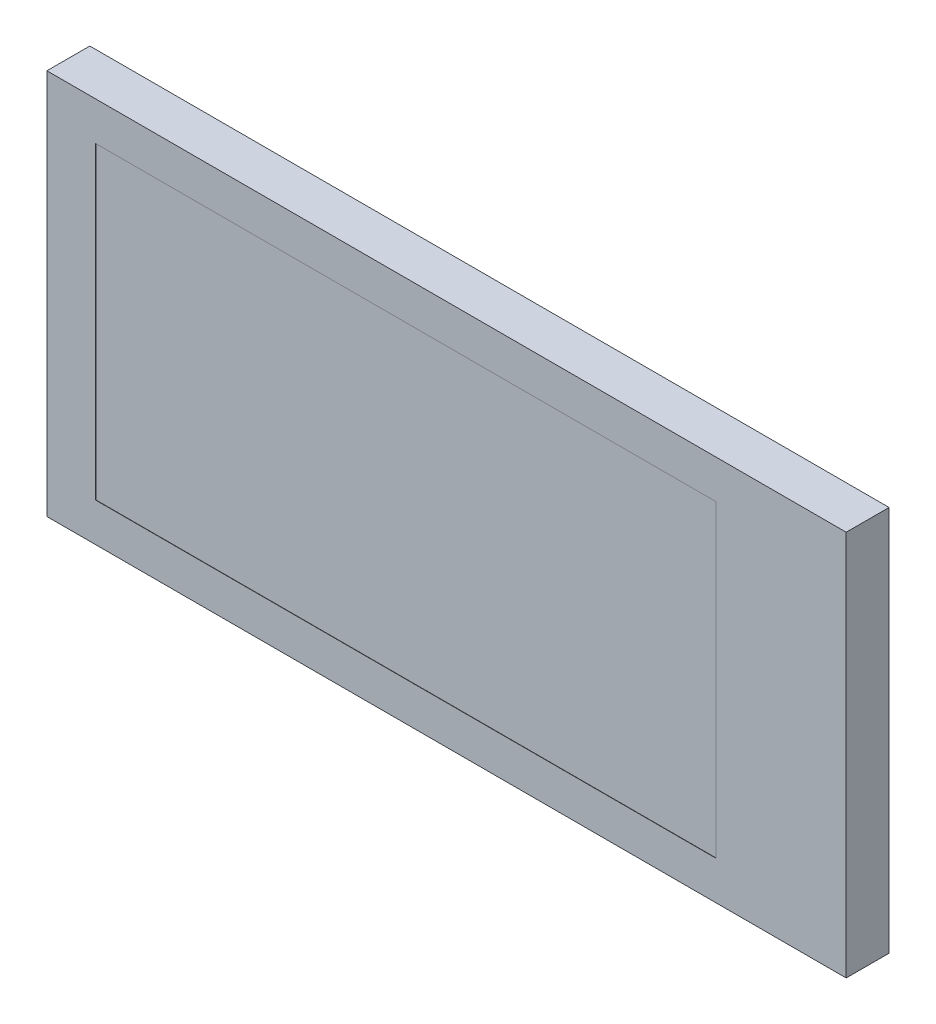
ISO-10303-21;
HEADER;
FILE_DESCRIPTION(('STEP AP214'),'2;1');
FILE_NAME('part.step','',(''),(''),'','','');
FILE_SCHEMA(('AUTOMOTIVE_DESIGN { 1 0 10303 214 1 1 1 1 }'));
ENDSEC;
DATA;
#1=APPLICATION_CONTEXT('core data for automotive mechanical design processes');
#2=APPLICATION_PROTOCOL_DEFINITION('international standard','automotive_design',2000,#1);
#3=PRODUCT_CONTEXT('',#1,'mechanical');
#4=PRODUCT('Part','Part','',(#3));
#5=PRODUCT_RELATED_PRODUCT_CATEGORY('part','',(#4));
#6=PRODUCT_DEFINITION_FORMATION('','',#4);
#7=PRODUCT_DEFINITION_CONTEXT('part definition',#1,'design');
#8=PRODUCT_DEFINITION('design','',#6,#7);
#9=PRODUCT_DEFINITION_SHAPE('','',#8);
#10=(LENGTH_UNIT() NAMED_UNIT(*) SI_UNIT(.MILLI.,.METRE.));
#11=(NAMED_UNIT(*) PLANE_ANGLE_UNIT() SI_UNIT($,.RADIAN.));
#12=(NAMED_UNIT(*) SI_UNIT($,.STERADIAN.) SOLID_ANGLE_UNIT());
#13=UNCERTAINTY_MEASURE_WITH_UNIT(LENGTH_MEASURE(1.E-05),#10,'distance_accuracy_value','');
#14=(GEOMETRIC_REPRESENTATION_CONTEXT(3) GLOBAL_UNCERTAINTY_ASSIGNED_CONTEXT((#13)) GLOBAL_UNIT_ASSIGNED_CONTEXT((#10,
#11,#12)) REPRESENTATION_CONTEXT('',''));
#15=CARTESIAN_POINT('',(0.,0.,0.));
#16=DIRECTION('',(0.,0.,1.));
#17=DIRECTION('',(1.,0.,0.));
#18=AXIS2_PLACEMENT_3D('',#15,#16,#17);
#19=CARTESIAN_POINT('',(0.,0.,1.5));
#20=DIRECTION('',(0.,0.,-1.));
#21=DIRECTION('',(-1.,0.,0.));
#22=AXIS2_PLACEMENT_3D('',#19,#20,#21);
#23=PLANE('',#22);
#24=DIRECTION('',(0.,-1.,0.));
#25=VECTOR('',#24,1.);
#26=CARTESIAN_POINT('',(0.,0.,1.5));
#27=LINE('',#26,#25);
#28=CARTESIAN_POINT('',(0.,13.5,1.5));
#29=VERTEX_POINT('',#28);
#30=CARTESIAN_POINT('',(0.,0.,1.5));
#31=VERTEX_POINT('',#30);
#32=EDGE_CURVE('E153',#29,#31,#27,.T.);
#33=ORIENTED_EDGE('',*,*,#32,.T.);
#34=DIRECTION('',(1.,0.,0.));
#35=VECTOR('',#34,1.);
#36=CARTESIAN_POINT('',(0.,0.,1.5));
#37=LINE('',#36,#35);
#38=CARTESIAN_POINT('',(27.95,0.,1.5));
#39=VERTEX_POINT('',#38);
#40=EDGE_CURVE('E157',#31,#39,#37,.T.);
#41=ORIENTED_EDGE('',*,*,#40,.T.);
#42=DIRECTION('',(0.,1.,0.));
#43=VECTOR('',#42,1.);
#44=CARTESIAN_POINT('',(27.95,0.,1.5));
#45=LINE('',#44,#43);
#46=CARTESIAN_POINT('',(27.95,13.5,1.5));
#47=VERTEX_POINT('',#46);
#48=EDGE_CURVE('E161',#39,#47,#45,.T.);
#49=ORIENTED_EDGE('',*,*,#48,.T.);
#50=DIRECTION('',(-1.,0.,0.));
#51=VECTOR('',#50,1.);
#52=CARTESIAN_POINT('',(0.,13.5,1.5));
#53=LINE('',#52,#51);
#54=EDGE_CURVE('E164',#47,#29,#53,.T.);
#55=ORIENTED_EDGE('',*,*,#54,.T.);
#56=EDGE_LOOP('',(#33,#41,#49,#55));
#57=FACE_BOUND('',#56,.T.);
#58=DIRECTION('',(0.,-1.,0.));
#59=VECTOR('',#58,1.);
#60=CARTESIAN_POINT('',(1.7,1.35,1.5));
#61=LINE('',#60,#59);
#62=CARTESIAN_POINT('',(1.7,12.15,1.5));
#63=VERTEX_POINT('',#62);
#64=CARTESIAN_POINT('',(1.7,1.35,1.5));
#65=VERTEX_POINT('',#64);
#66=EDGE_CURVE('E125',#63,#65,#61,.T.);
#67=ORIENTED_EDGE('',*,*,#66,.F.);
#68=DIRECTION('',(-1.,0.,0.));
#69=VECTOR('',#68,1.);
#70=CARTESIAN_POINT('',(1.7,12.15,1.5));
#71=LINE('',#70,#69);
#72=CARTESIAN_POINT('',(23.4,12.15,1.5));
#73=VERTEX_POINT('',#72);
#74=EDGE_CURVE('E113',#73,#63,#71,.T.);
#75=ORIENTED_EDGE('',*,*,#74,.F.);
#76=DIRECTION('',(0.,1.,0.));
#77=VECTOR('',#76,1.);
#78=CARTESIAN_POINT('',(23.4,1.35,1.5));
#79=LINE('',#78,#77);
#80=CARTESIAN_POINT('',(23.4,1.35,1.5));
#81=VERTEX_POINT('',#80);
#82=EDGE_CURVE('E139',#81,#73,#79,.T.);
#83=ORIENTED_EDGE('',*,*,#82,.F.);
#84=DIRECTION('',(1.,0.,0.));
#85=VECTOR('',#84,1.);
#86=CARTESIAN_POINT('',(1.7,1.35,1.5));
#87=LINE('',#86,#85);
#88=EDGE_CURVE('E136',#65,#81,#87,.T.);
#89=ORIENTED_EDGE('',*,*,#88,.F.);
#90=EDGE_LOOP('',(#67,#75,#83,#89));
#91=FACE_BOUND('',#90,.T.);
#92=ADVANCED_FACE('F39',(#57,#91),#23,.F.);
#93=CARTESIAN_POINT('',(0.,0.,0.));
#94=DIRECTION('',(0.,0.,-1.));
#95=DIRECTION('',(-1.,0.,0.));
#96=AXIS2_PLACEMENT_3D('',#93,#94,#95);
#97=PLANE('',#96);
#98=DIRECTION('',(0.,-1.,0.));
#99=VECTOR('',#98,1.);
#100=CARTESIAN_POINT('',(0.,0.,0.));
#101=LINE('',#100,#99);
#102=CARTESIAN_POINT('',(0.,13.5,0.));
#103=VERTEX_POINT('',#102);
#104=CARTESIAN_POINT('',(0.,0.,0.));
#105=VERTEX_POINT('',#104);
#106=EDGE_CURVE('E152',#103,#105,#101,.T.);
#107=ORIENTED_EDGE('',*,*,#106,.F.);
#108=DIRECTION('',(-1.,0.,0.));
#109=VECTOR('',#108,1.);
#110=CARTESIAN_POINT('',(0.,13.5,0.));
#111=LINE('',#110,#109);
#112=CARTESIAN_POINT('',(27.95,13.5,0.));
#113=VERTEX_POINT('',#112);
#114=EDGE_CURVE('E158',#113,#103,#111,.T.);
#115=ORIENTED_EDGE('',*,*,#114,.F.);
#116=DIRECTION('',(0.,1.,0.));
#117=VECTOR('',#116,1.);
#118=CARTESIAN_POINT('',(27.95,0.,0.));
#119=LINE('',#118,#117);
#120=CARTESIAN_POINT('',(27.95,0.,0.));
#121=VERTEX_POINT('',#120);
#122=EDGE_CURVE('E174',#121,#113,#119,.T.);
#123=ORIENTED_EDGE('',*,*,#122,.F.);
#124=DIRECTION('',(1.,0.,0.));
#125=VECTOR('',#124,1.);
#126=CARTESIAN_POINT('',(0.,0.,0.));
#127=LINE('',#126,#125);
#128=EDGE_CURVE('E171',#105,#121,#127,.T.);
#129=ORIENTED_EDGE('',*,*,#128,.F.);
#130=EDGE_LOOP('',(#107,#115,#123,#129));
#131=FACE_BOUND('',#130,.T.);
#132=ADVANCED_FACE('F197',(#131),#97,.T.);
#133=CARTESIAN_POINT('',(0.,0.,1.5));
#134=DIRECTION('',(1.,0.,0.));
#135=DIRECTION('',(0.,0.,-1.));
#136=AXIS2_PLACEMENT_3D('',#133,#134,#135);
#137=PLANE('',#136);
#138=ORIENTED_EDGE('',*,*,#106,.T.);
#139=DIRECTION('',(0.,0.,-1.));
#140=VECTOR('',#139,1.);
#141=CARTESIAN_POINT('',(0.,0.,1.5));
#142=LINE('',#141,#140);
#143=EDGE_CURVE('E11',#31,#105,#142,.T.);
#144=ORIENTED_EDGE('',*,*,#143,.F.);
#145=ORIENTED_EDGE('',*,*,#32,.F.);
#146=DIRECTION('',(0.,0.,-1.));
#147=VECTOR('',#146,1.);
#148=CARTESIAN_POINT('',(0.,13.5,1.5));
#149=LINE('',#148,#147);
#150=EDGE_CURVE('E167',#29,#103,#149,.T.);
#151=ORIENTED_EDGE('',*,*,#150,.T.);
#152=EDGE_LOOP('',(#138,#144,#145,#151));
#153=FACE_BOUND('',#152,.T.);
#154=ADVANCED_FACE('F41',(#153),#137,.F.);
#155=CARTESIAN_POINT('',(0.,0.,1.5));
#156=DIRECTION('',(0.,1.,0.));
#157=DIRECTION('',(0.,0.,1.));
#158=AXIS2_PLACEMENT_3D('',#155,#156,#157);
#159=PLANE('',#158);
#160=ORIENTED_EDGE('',*,*,#128,.T.);
#161=DIRECTION('',(0.,0.,-1.));
#162=VECTOR('',#161,1.);
#163=CARTESIAN_POINT('',(27.95,0.,1.5));
#164=LINE('',#163,#162);
#165=EDGE_CURVE('E48',#39,#121,#164,.T.);
#166=ORIENTED_EDGE('',*,*,#165,.F.);
#167=ORIENTED_EDGE('',*,*,#40,.F.);
#168=ORIENTED_EDGE('',*,*,#143,.T.);
#169=EDGE_LOOP('',(#160,#166,#167,#168));
#170=FACE_BOUND('',#169,.T.);
#171=ADVANCED_FACE('F207',(#170),#159,.F.);
#172=CARTESIAN_POINT('',(27.95,0.,1.5));
#173=DIRECTION('',(-1.,0.,0.));
#174=DIRECTION('',(0.,0.,1.));
#175=AXIS2_PLACEMENT_3D('',#172,#173,#174);
#176=PLANE('',#175);
#177=ORIENTED_EDGE('',*,*,#122,.T.);
#178=DIRECTION('',(0.,0.,-1.));
#179=VECTOR('',#178,1.);
#180=CARTESIAN_POINT('',(27.95,13.5,1.5));
#181=LINE('',#180,#179);
#182=EDGE_CURVE('E182',#47,#113,#181,.T.);
#183=ORIENTED_EDGE('',*,*,#182,.F.);
#184=ORIENTED_EDGE('',*,*,#48,.F.);
#185=ORIENTED_EDGE('',*,*,#165,.T.);
#186=EDGE_LOOP('',(#177,#183,#184,#185));
#187=FACE_BOUND('',#186,.T.);
#188=ADVANCED_FACE('F191',(#187),#176,.F.);
#189=CARTESIAN_POINT('',(0.,13.5,1.5));
#190=DIRECTION('',(0.,-1.,0.));
#191=DIRECTION('',(0.,0.,-1.));
#192=AXIS2_PLACEMENT_3D('',#189,#190,#191);
#193=PLANE('',#192);
#194=ORIENTED_EDGE('',*,*,#114,.T.);
#195=ORIENTED_EDGE('',*,*,#150,.F.);
#196=ORIENTED_EDGE('',*,*,#54,.F.);
#197=ORIENTED_EDGE('',*,*,#182,.T.);
#198=EDGE_LOOP('',(#194,#195,#196,#197));
#199=FACE_BOUND('',#198,.T.);
#200=ADVANCED_FACE('F200',(#199),#193,.F.);
#201=CARTESIAN_POINT('',(1.7,1.35,1.5));
#202=DIRECTION('',(1.,0.,0.));
#203=DIRECTION('',(0.,0.,-1.));
#204=AXIS2_PLACEMENT_3D('',#201,#202,#203);
#205=PLANE('',#204);
#206=DIRECTION('',(0.,1.,0.));
#207=VECTOR('',#206,1.);
#208=CARTESIAN_POINT('',(1.7,0.,1.49));
#209=LINE('',#208,#207);
#210=CARTESIAN_POINT('',(1.7,1.35,1.49));
#211=VERTEX_POINT('',#210);
#212=CARTESIAN_POINT('',(1.7,12.15,1.49));
#213=VERTEX_POINT('',#212);
#214=EDGE_CURVE('E120',#211,#213,#209,.T.);
#215=ORIENTED_EDGE('',*,*,#214,.T.);
#216=DIRECTION('',(0.,0.,-1.));
#217=VECTOR('',#216,1.);
#218=CARTESIAN_POINT('',(1.7,12.15,1.5));
#219=LINE('',#218,#217);
#220=EDGE_CURVE('E107',#63,#213,#219,.T.);
#221=ORIENTED_EDGE('',*,*,#220,.F.);
#222=ORIENTED_EDGE('',*,*,#66,.T.);
#223=DIRECTION('',(0.,0.,-1.));
#224=VECTOR('',#223,1.);
#225=CARTESIAN_POINT('',(1.7,1.35,1.5));
#226=LINE('',#225,#224);
#227=EDGE_CURVE('E122',#65,#211,#226,.T.);
#228=ORIENTED_EDGE('',*,*,#227,.T.);
#229=EDGE_LOOP('',(#215,#221,#222,#228));
#230=FACE_BOUND('',#229,.T.);
#231=ADVANCED_FACE('F121',(#230),#205,.T.);
#232=CARTESIAN_POINT('',(1.7,1.35,1.5));
#233=DIRECTION('',(0.,1.,0.));
#234=DIRECTION('',(0.,0.,1.));
#235=AXIS2_PLACEMENT_3D('',#232,#233,#234);
#236=PLANE('',#235);
#237=DIRECTION('',(1.,0.,0.));
#238=VECTOR('',#237,1.);
#239=CARTESIAN_POINT('',(0.,1.35,1.49));
#240=LINE('',#239,#238);
#241=CARTESIAN_POINT('',(23.4,1.35,1.49));
#242=VERTEX_POINT('',#241);
#243=EDGE_CURVE('E55',#211,#242,#240,.T.);
#244=ORIENTED_EDGE('',*,*,#243,.F.);
#245=ORIENTED_EDGE('',*,*,#227,.F.);
#246=ORIENTED_EDGE('',*,*,#88,.T.);
#247=DIRECTION('',(0.,0.,-1.));
#248=VECTOR('',#247,1.);
#249=CARTESIAN_POINT('',(23.4,1.35,1.5));
#250=LINE('',#249,#248);
#251=EDGE_CURVE('E147',#81,#242,#250,.T.);
#252=ORIENTED_EDGE('',*,*,#251,.T.);
#253=EDGE_LOOP('',(#244,#245,#246,#252));
#254=FACE_BOUND('',#253,.T.);
#255=ADVANCED_FACE('F227',(#254),#236,.T.);
#256=CARTESIAN_POINT('',(23.4,1.35,1.5));
#257=DIRECTION('',(-1.,0.,0.));
#258=DIRECTION('',(0.,0.,1.));
#259=AXIS2_PLACEMENT_3D('',#256,#257,#258);
#260=PLANE('',#259);
#261=DIRECTION('',(0.,1.,0.));
#262=VECTOR('',#261,1.);
#263=CARTESIAN_POINT('',(23.4,0.,1.49));
#264=LINE('',#263,#262);
#265=CARTESIAN_POINT('',(23.4,12.15,1.49));
#266=VERTEX_POINT('',#265);
#267=EDGE_CURVE('E63',#242,#266,#264,.T.);
#268=ORIENTED_EDGE('',*,*,#267,.F.);
#269=ORIENTED_EDGE('',*,*,#251,.F.);
#270=ORIENTED_EDGE('',*,*,#82,.T.);
#271=DIRECTION('',(0.,0.,-1.));
#272=VECTOR('',#271,1.);
#273=CARTESIAN_POINT('',(23.4,12.15,1.5));
#274=LINE('',#273,#272);
#275=EDGE_CURVE('E117',#73,#266,#274,.T.);
#276=ORIENTED_EDGE('',*,*,#275,.T.);
#277=EDGE_LOOP('',(#268,#269,#270,#276));
#278=FACE_BOUND('',#277,.T.);
#279=ADVANCED_FACE('F231',(#278),#260,.T.);
#280=CARTESIAN_POINT('',(1.7,12.15,1.5));
#281=DIRECTION('',(0.,-1.,0.));
#282=DIRECTION('',(0.,0.,-1.));
#283=AXIS2_PLACEMENT_3D('',#280,#281,#282);
#284=PLANE('',#283);
#285=DIRECTION('',(1.,0.,0.));
#286=VECTOR('',#285,1.);
#287=CARTESIAN_POINT('',(0.,12.15,1.49));
#288=LINE('',#287,#286);
#289=EDGE_CURVE('E111',#213,#266,#288,.T.);
#290=ORIENTED_EDGE('',*,*,#289,.T.);
#291=ORIENTED_EDGE('',*,*,#275,.F.);
#292=ORIENTED_EDGE('',*,*,#74,.T.);
#293=ORIENTED_EDGE('',*,*,#220,.T.);
#294=EDGE_LOOP('',(#290,#291,#292,#293));
#295=FACE_BOUND('',#294,.T.);
#296=ADVANCED_FACE('F109',(#295),#284,.T.);
#297=CARTESIAN_POINT('',(0.,0.,1.49));
#298=DIRECTION('',(0.,0.,1.));
#299=DIRECTION('',(1.,0.,0.));
#300=AXIS2_PLACEMENT_3D('',#297,#298,#299);
#301=PLANE('',#300);
#302=ORIENTED_EDGE('',*,*,#243,.T.);
#303=ORIENTED_EDGE('',*,*,#267,.T.);
#304=ORIENTED_EDGE('',*,*,#289,.F.);
#305=ORIENTED_EDGE('',*,*,#214,.F.);
#306=EDGE_LOOP('',(#302,#303,#304,#305));
#307=FACE_BOUND('',#306,.T.);
#308=ADVANCED_FACE('F127',(#307),#301,.T.);
#309=CLOSED_SHELL('',(#92,#132,#154,#171,#188,#200,#231,#255,#279,#296,#308));
#310=MANIFOLD_SOLID_BREP('B2',#309);
#311=ADVANCED_BREP_SHAPE_REPRESENTATION('',(#18,#310),#14);
#312=SHAPE_DEFINITION_REPRESENTATION(#9,#311);
ENDSEC;
END-ISO-10303-21;
